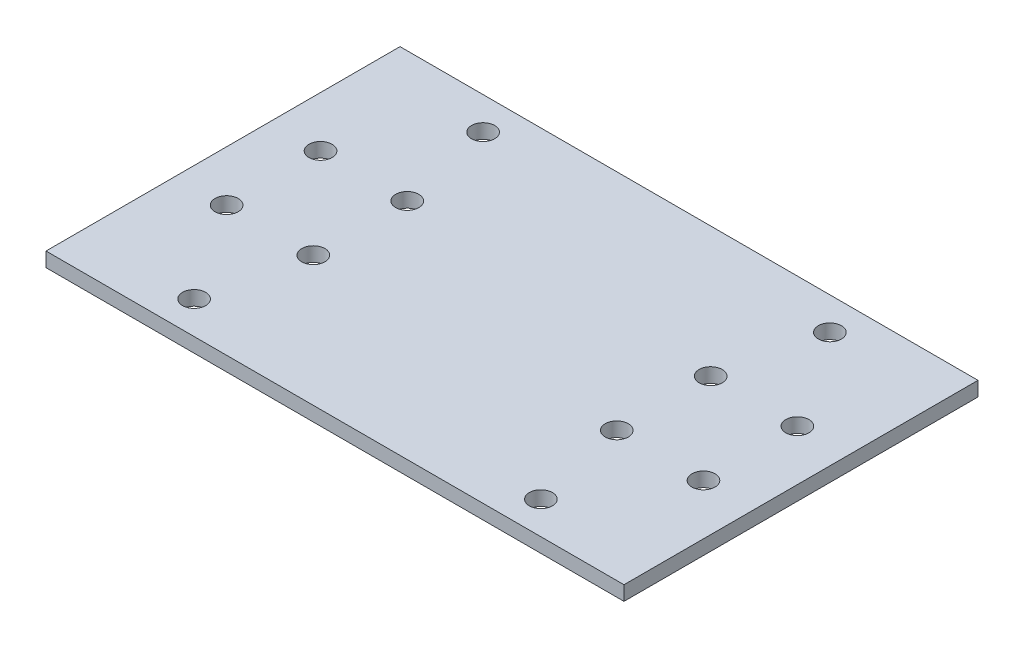
ISO-10303-21;
HEADER;
FILE_DESCRIPTION(('STEP AP214'),'2;1');
FILE_NAME('part.step','',(''),(''),'','','');
FILE_SCHEMA(('AUTOMOTIVE_DESIGN { 1 0 10303 214 1 1 1 1 }'));
ENDSEC;
DATA;
#1=APPLICATION_CONTEXT('core data for automotive mechanical design processes');
#2=APPLICATION_PROTOCOL_DEFINITION('international standard','automotive_design',2000,#1);
#3=PRODUCT_CONTEXT('',#1,'mechanical');
#4=PRODUCT('Part','Part','',(#3));
#5=PRODUCT_RELATED_PRODUCT_CATEGORY('part','',(#4));
#6=PRODUCT_DEFINITION_FORMATION('','',#4);
#7=PRODUCT_DEFINITION_CONTEXT('part definition',#1,'design');
#8=PRODUCT_DEFINITION('design','',#6,#7);
#9=PRODUCT_DEFINITION_SHAPE('','',#8);
#10=(LENGTH_UNIT() NAMED_UNIT(*) SI_UNIT(.MILLI.,.METRE.));
#11=(NAMED_UNIT(*) PLANE_ANGLE_UNIT() SI_UNIT($,.RADIAN.));
#12=(NAMED_UNIT(*) SI_UNIT($,.STERADIAN.) SOLID_ANGLE_UNIT());
#13=UNCERTAINTY_MEASURE_WITH_UNIT(LENGTH_MEASURE(1.E-05),#10,'distance_accuracy_value','');
#14=(GEOMETRIC_REPRESENTATION_CONTEXT(3) GLOBAL_UNCERTAINTY_ASSIGNED_CONTEXT((#13)) GLOBAL_UNIT_ASSIGNED_CONTEXT((#10,
#11,#12)) REPRESENTATION_CONTEXT('',''));
#15=CARTESIAN_POINT('',(0.,0.,0.));
#16=DIRECTION('',(0.,0.,1.));
#17=DIRECTION('',(1.,0.,0.));
#18=AXIS2_PLACEMENT_3D('',#15,#16,#17);
#19=CARTESIAN_POINT('',(0.,2.,0.));
#20=DIRECTION('',(0.,-1.,0.));
#21=DIRECTION('',(0.,0.,-1.));
#22=AXIS2_PLACEMENT_3D('',#19,#20,#21);
#23=PLANE('',#22);
#24=DIRECTION('',(0.,0.,-1.));
#25=VECTOR('',#24,1.);
#26=CARTESIAN_POINT('',(40.,2.,24.5));
#27=LINE('',#26,#25);
#28=CARTESIAN_POINT('',(40.,2.,24.5));
#29=VERTEX_POINT('',#28);
#30=CARTESIAN_POINT('',(40.,2.,-24.5));
#31=VERTEX_POINT('',#30);
#32=EDGE_CURVE('E85',#29,#31,#27,.T.);
#33=ORIENTED_EDGE('',*,*,#32,.T.);
#34=DIRECTION('',(-1.,0.,0.));
#35=VECTOR('',#34,1.);
#36=CARTESIAN_POINT('',(-40.,2.,-24.5));
#37=LINE('',#36,#35);
#38=CARTESIAN_POINT('',(-40.,2.,-24.5));
#39=VERTEX_POINT('',#38);
#40=EDGE_CURVE('E80',#31,#39,#37,.T.);
#41=ORIENTED_EDGE('',*,*,#40,.T.);
#42=DIRECTION('',(0.,0.,1.));
#43=VECTOR('',#42,1.);
#44=CARTESIAN_POINT('',(-40.,2.,24.5));
#45=LINE('',#44,#43);
#46=CARTESIAN_POINT('',(-40.,2.,24.5));
#47=VERTEX_POINT('',#46);
#48=EDGE_CURVE('E83',#39,#47,#45,.T.);
#49=ORIENTED_EDGE('',*,*,#48,.T.);
#50=DIRECTION('',(1.,0.,0.));
#51=VECTOR('',#50,1.);
#52=CARTESIAN_POINT('',(-40.,2.,24.5));
#53=LINE('',#52,#51);
#54=EDGE_CURVE('E50',#47,#29,#53,.T.);
#55=ORIENTED_EDGE('',*,*,#54,.T.);
#56=EDGE_LOOP('',(#33,#41,#49,#55));
#57=FACE_BOUND('',#56,.T.);
#58=CARTESIAN_POINT('',(-33.,2.,-6.5));
#59=DIRECTION('',(0.,1.,0.));
#60=DIRECTION('',(0.,0.,1.));
#61=AXIS2_PLACEMENT_3D('',#58,#59,#60);
#62=CIRCLE('',#61,1.60000000000001);
#63=CARTESIAN_POINT('',(-33.,2.,-4.89999999999999));
#64=VERTEX_POINT('',#63);
#65=EDGE_CURVE('E100',#64,#64,#62,.T.);
#66=ORIENTED_EDGE('',*,*,#65,.F.);
#67=EDGE_LOOP('',(#66));
#68=FACE_BOUND('',#67,.T.);
#69=CARTESIAN_POINT('',(33.,2.,-6.5));
#70=DIRECTION('',(0.,1.,0.));
#71=DIRECTION('',(0.,0.,-1.));
#72=AXIS2_PLACEMENT_3D('',#69,#70,#71);
#73=CIRCLE('',#72,1.6);
#74=CARTESIAN_POINT('',(33.,2.,-8.1));
#75=VERTEX_POINT('',#74);
#76=EDGE_CURVE('E115',#75,#75,#73,.T.);
#77=ORIENTED_EDGE('',*,*,#76,.F.);
#78=EDGE_LOOP('',(#77));
#79=FACE_BOUND('',#78,.T.);
#80=CARTESIAN_POINT('',(33.,2.,6.5));
#81=DIRECTION('',(0.,1.,0.));
#82=DIRECTION('',(0.,0.,1.));
#83=AXIS2_PLACEMENT_3D('',#80,#81,#82);
#84=CIRCLE('',#83,1.60000000000001);
#85=CARTESIAN_POINT('',(33.,2.,8.1));
#86=VERTEX_POINT('',#85);
#87=EDGE_CURVE('E121',#86,#86,#84,.T.);
#88=ORIENTED_EDGE('',*,*,#87,.F.);
#89=EDGE_LOOP('',(#88));
#90=FACE_BOUND('',#89,.T.);
#91=CARTESIAN_POINT('',(-33.,2.,6.5));
#92=DIRECTION('',(0.,1.,0.));
#93=DIRECTION('',(0.,0.,-1.));
#94=AXIS2_PLACEMENT_3D('',#91,#92,#93);
#95=CIRCLE('',#94,1.60000000000001);
#96=CARTESIAN_POINT('',(-33.,2.,4.89999999999999));
#97=VERTEX_POINT('',#96);
#98=EDGE_CURVE('E127',#97,#97,#95,.T.);
#99=ORIENTED_EDGE('',*,*,#98,.F.);
#100=EDGE_LOOP('',(#99));
#101=FACE_BOUND('',#100,.T.);
#102=CARTESIAN_POINT('',(21.,2.,-6.5));
#103=DIRECTION('',(0.,1.,0.));
#104=DIRECTION('',(0.,0.,-1.));
#105=AXIS2_PLACEMENT_3D('',#102,#103,#104);
#106=CIRCLE('',#105,1.6);
#107=CARTESIAN_POINT('',(21.,2.,-8.10000000000001));
#108=VERTEX_POINT('',#107);
#109=EDGE_CURVE('E133',#108,#108,#106,.T.);
#110=ORIENTED_EDGE('',*,*,#109,.F.);
#111=EDGE_LOOP('',(#110));
#112=FACE_BOUND('',#111,.T.);
#113=CARTESIAN_POINT('',(-21.,2.,-6.5));
#114=DIRECTION('',(0.,1.,0.));
#115=DIRECTION('',(0.,0.,1.));
#116=AXIS2_PLACEMENT_3D('',#113,#114,#115);
#117=CIRCLE('',#116,1.6);
#118=CARTESIAN_POINT('',(-21.,2.,-4.9));
#119=VERTEX_POINT('',#118);
#120=EDGE_CURVE('E139',#119,#119,#117,.T.);
#121=ORIENTED_EDGE('',*,*,#120,.F.);
#122=EDGE_LOOP('',(#121));
#123=FACE_BOUND('',#122,.T.);
#124=CARTESIAN_POINT('',(-21.,2.,6.50000000000001));
#125=DIRECTION('',(0.,1.,0.));
#126=DIRECTION('',(0.,0.,-1.));
#127=AXIS2_PLACEMENT_3D('',#124,#125,#126);
#128=CIRCLE('',#127,1.6);
#129=CARTESIAN_POINT('',(-21.,2.,4.90000000000001));
#130=VERTEX_POINT('',#129);
#131=EDGE_CURVE('E145',#130,#130,#128,.T.);
#132=ORIENTED_EDGE('',*,*,#131,.F.);
#133=EDGE_LOOP('',(#132));
#134=FACE_BOUND('',#133,.T.);
#135=CARTESIAN_POINT('',(21.,2.,6.5));
#136=DIRECTION('',(0.,1.,0.));
#137=DIRECTION('',(0.,0.,1.));
#138=AXIS2_PLACEMENT_3D('',#135,#136,#137);
#139=CIRCLE('',#138,1.6);
#140=CARTESIAN_POINT('',(21.,2.,8.10000000000001));
#141=VERTEX_POINT('',#140);
#142=EDGE_CURVE('E151',#141,#141,#139,.T.);
#143=ORIENTED_EDGE('',*,*,#142,.F.);
#144=EDGE_LOOP('',(#143));
#145=FACE_BOUND('',#144,.T.);
#146=CARTESIAN_POINT('',(24.,2.,20.));
#147=DIRECTION('',(0.,1.,0.));
#148=DIRECTION('',(0.,0.,-1.));
#149=AXIS2_PLACEMENT_3D('',#146,#147,#148);
#150=CIRCLE('',#149,1.6);
#151=CARTESIAN_POINT('',(24.,2.,18.4));
#152=VERTEX_POINT('',#151);
#153=EDGE_CURVE('E157',#152,#152,#150,.T.);
#154=ORIENTED_EDGE('',*,*,#153,.F.);
#155=EDGE_LOOP('',(#154));
#156=FACE_BOUND('',#155,.T.);
#157=CARTESIAN_POINT('',(24.,2.,-20.));
#158=DIRECTION('',(0.,1.,0.));
#159=DIRECTION('',(0.,0.,1.));
#160=AXIS2_PLACEMENT_3D('',#157,#158,#159);
#161=CIRCLE('',#160,1.6);
#162=CARTESIAN_POINT('',(24.,2.,-18.4));
#163=VERTEX_POINT('',#162);
#164=EDGE_CURVE('E163',#163,#163,#161,.T.);
#165=ORIENTED_EDGE('',*,*,#164,.F.);
#166=EDGE_LOOP('',(#165));
#167=FACE_BOUND('',#166,.T.);
#168=CARTESIAN_POINT('',(-24.,2.,-20.));
#169=DIRECTION('',(0.,1.,0.));
#170=DIRECTION('',(0.,0.,-1.));
#171=AXIS2_PLACEMENT_3D('',#168,#169,#170);
#172=CIRCLE('',#171,1.6);
#173=CARTESIAN_POINT('',(-24.,2.,-21.6));
#174=VERTEX_POINT('',#173);
#175=EDGE_CURVE('E169',#174,#174,#172,.T.);
#176=ORIENTED_EDGE('',*,*,#175,.F.);
#177=EDGE_LOOP('',(#176));
#178=FACE_BOUND('',#177,.T.);
#179=CARTESIAN_POINT('',(-24.,2.,20.));
#180=DIRECTION('',(0.,1.,0.));
#181=DIRECTION('',(0.,0.,1.));
#182=AXIS2_PLACEMENT_3D('',#179,#180,#181);
#183=CIRCLE('',#182,1.6);
#184=CARTESIAN_POINT('',(-24.,2.,21.6));
#185=VERTEX_POINT('',#184);
#186=EDGE_CURVE('E175',#185,#185,#183,.T.);
#187=ORIENTED_EDGE('',*,*,#186,.F.);
#188=EDGE_LOOP('',(#187));
#189=FACE_BOUND('',#188,.T.);
#190=ADVANCED_FACE('F33',(#57,#68,#79,#90,#101,#112,#123,#134,#145,#156,#167,#178,#189),#23,.F.);
#191=CARTESIAN_POINT('',(0.,0.,0.));
#192=DIRECTION('',(0.,-1.,0.));
#193=DIRECTION('',(0.,0.,-1.));
#194=AXIS2_PLACEMENT_3D('',#191,#192,#193);
#195=PLANE('',#194);
#196=CARTESIAN_POINT('',(-24.,0.,-20.));
#197=DIRECTION('',(0.,1.,0.));
#198=DIRECTION('',(0.,0.,-1.));
#199=AXIS2_PLACEMENT_3D('',#196,#197,#198);
#200=CIRCLE('',#199,1.6);
#201=CARTESIAN_POINT('',(-24.,0.,-21.6));
#202=VERTEX_POINT('',#201);
#203=EDGE_CURVE('E172',#202,#202,#200,.T.);
#204=ORIENTED_EDGE('',*,*,#203,.T.);
#205=EDGE_LOOP('',(#204));
#206=FACE_BOUND('',#205,.T.);
#207=CARTESIAN_POINT('',(24.,0.,20.));
#208=DIRECTION('',(0.,1.,0.));
#209=DIRECTION('',(0.,0.,-1.));
#210=AXIS2_PLACEMENT_3D('',#207,#208,#209);
#211=CIRCLE('',#210,1.6);
#212=CARTESIAN_POINT('',(24.,0.,18.4));
#213=VERTEX_POINT('',#212);
#214=EDGE_CURVE('E160',#213,#213,#211,.T.);
#215=ORIENTED_EDGE('',*,*,#214,.T.);
#216=EDGE_LOOP('',(#215));
#217=FACE_BOUND('',#216,.T.);
#218=CARTESIAN_POINT('',(-21.,0.,6.50000000000001));
#219=DIRECTION('',(0.,1.,0.));
#220=DIRECTION('',(0.,0.,-1.));
#221=AXIS2_PLACEMENT_3D('',#218,#219,#220);
#222=CIRCLE('',#221,1.6);
#223=CARTESIAN_POINT('',(-21.,0.,4.90000000000001));
#224=VERTEX_POINT('',#223);
#225=EDGE_CURVE('E148',#224,#224,#222,.T.);
#226=ORIENTED_EDGE('',*,*,#225,.T.);
#227=EDGE_LOOP('',(#226));
#228=FACE_BOUND('',#227,.T.);
#229=CARTESIAN_POINT('',(21.,0.,-6.5));
#230=DIRECTION('',(0.,1.,0.));
#231=DIRECTION('',(0.,0.,-1.));
#232=AXIS2_PLACEMENT_3D('',#229,#230,#231);
#233=CIRCLE('',#232,1.6);
#234=CARTESIAN_POINT('',(21.,0.,-8.10000000000001));
#235=VERTEX_POINT('',#234);
#236=EDGE_CURVE('E136',#235,#235,#233,.T.);
#237=ORIENTED_EDGE('',*,*,#236,.T.);
#238=EDGE_LOOP('',(#237));
#239=FACE_BOUND('',#238,.T.);
#240=CARTESIAN_POINT('',(33.,0.,6.5));
#241=DIRECTION('',(0.,1.,0.));
#242=DIRECTION('',(0.,0.,1.));
#243=AXIS2_PLACEMENT_3D('',#240,#241,#242);
#244=CIRCLE('',#243,1.60000000000001);
#245=CARTESIAN_POINT('',(33.,0.,8.1));
#246=VERTEX_POINT('',#245);
#247=EDGE_CURVE('E124',#246,#246,#244,.T.);
#248=ORIENTED_EDGE('',*,*,#247,.T.);
#249=EDGE_LOOP('',(#248));
#250=FACE_BOUND('',#249,.T.);
#251=CARTESIAN_POINT('',(-33.,0.,-6.5));
#252=DIRECTION('',(0.,1.,0.));
#253=DIRECTION('',(0.,0.,1.));
#254=AXIS2_PLACEMENT_3D('',#251,#252,#253);
#255=CIRCLE('',#254,1.60000000000001);
#256=CARTESIAN_POINT('',(-33.,0.,-4.89999999999999));
#257=VERTEX_POINT('',#256);
#258=EDGE_CURVE('E112',#257,#257,#255,.T.);
#259=ORIENTED_EDGE('',*,*,#258,.T.);
#260=EDGE_LOOP('',(#259));
#261=FACE_BOUND('',#260,.T.);
#262=DIRECTION('',(0.,0.,-1.));
#263=VECTOR('',#262,1.);
#264=CARTESIAN_POINT('',(40.,0.,24.5));
#265=LINE('',#264,#263);
#266=CARTESIAN_POINT('',(40.,0.,24.5));
#267=VERTEX_POINT('',#266);
#268=CARTESIAN_POINT('',(40.,0.,-24.5));
#269=VERTEX_POINT('',#268);
#270=EDGE_CURVE('E97',#267,#269,#265,.T.);
#271=ORIENTED_EDGE('',*,*,#270,.F.);
#272=DIRECTION('',(1.,0.,0.));
#273=VECTOR('',#272,1.);
#274=CARTESIAN_POINT('',(-40.,0.,24.5));
#275=LINE('',#274,#273);
#276=CARTESIAN_POINT('',(-40.,0.,24.5));
#277=VERTEX_POINT('',#276);
#278=EDGE_CURVE('E73',#277,#267,#275,.T.);
#279=ORIENTED_EDGE('',*,*,#278,.F.);
#280=DIRECTION('',(0.,0.,1.));
#281=VECTOR('',#280,1.);
#282=CARTESIAN_POINT('',(-40.,0.,24.5));
#283=LINE('',#282,#281);
#284=CARTESIAN_POINT('',(-40.,0.,-24.5));
#285=VERTEX_POINT('',#284);
#286=EDGE_CURVE('E67',#285,#277,#283,.T.);
#287=ORIENTED_EDGE('',*,*,#286,.F.);
#288=DIRECTION('',(-1.,0.,0.));
#289=VECTOR('',#288,1.);
#290=CARTESIAN_POINT('',(-40.,0.,-24.5));
#291=LINE('',#290,#289);
#292=EDGE_CURVE('E89',#269,#285,#291,.T.);
#293=ORIENTED_EDGE('',*,*,#292,.F.);
#294=EDGE_LOOP('',(#271,#279,#287,#293));
#295=FACE_BOUND('',#294,.T.);
#296=CARTESIAN_POINT('',(33.,0.,-6.5));
#297=DIRECTION('',(0.,1.,0.));
#298=DIRECTION('',(0.,0.,-1.));
#299=AXIS2_PLACEMENT_3D('',#296,#297,#298);
#300=CIRCLE('',#299,1.6);
#301=CARTESIAN_POINT('',(33.,0.,-8.1));
#302=VERTEX_POINT('',#301);
#303=EDGE_CURVE('E118',#302,#302,#300,.T.);
#304=ORIENTED_EDGE('',*,*,#303,.T.);
#305=EDGE_LOOP('',(#304));
#306=FACE_BOUND('',#305,.T.);
#307=CARTESIAN_POINT('',(-33.,0.,6.5));
#308=DIRECTION('',(0.,1.,0.));
#309=DIRECTION('',(0.,0.,-1.));
#310=AXIS2_PLACEMENT_3D('',#307,#308,#309);
#311=CIRCLE('',#310,1.60000000000001);
#312=CARTESIAN_POINT('',(-33.,0.,4.89999999999999));
#313=VERTEX_POINT('',#312);
#314=EDGE_CURVE('E130',#313,#313,#311,.T.);
#315=ORIENTED_EDGE('',*,*,#314,.T.);
#316=EDGE_LOOP('',(#315));
#317=FACE_BOUND('',#316,.T.);
#318=CARTESIAN_POINT('',(-21.,0.,-6.5));
#319=DIRECTION('',(0.,1.,0.));
#320=DIRECTION('',(0.,0.,1.));
#321=AXIS2_PLACEMENT_3D('',#318,#319,#320);
#322=CIRCLE('',#321,1.6);
#323=CARTESIAN_POINT('',(-21.,0.,-4.9));
#324=VERTEX_POINT('',#323);
#325=EDGE_CURVE('E142',#324,#324,#322,.T.);
#326=ORIENTED_EDGE('',*,*,#325,.T.);
#327=EDGE_LOOP('',(#326));
#328=FACE_BOUND('',#327,.T.);
#329=CARTESIAN_POINT('',(21.,0.,6.5));
#330=DIRECTION('',(0.,1.,0.));
#331=DIRECTION('',(0.,0.,1.));
#332=AXIS2_PLACEMENT_3D('',#329,#330,#331);
#333=CIRCLE('',#332,1.6);
#334=CARTESIAN_POINT('',(21.,0.,8.10000000000001));
#335=VERTEX_POINT('',#334);
#336=EDGE_CURVE('E154',#335,#335,#333,.T.);
#337=ORIENTED_EDGE('',*,*,#336,.T.);
#338=EDGE_LOOP('',(#337));
#339=FACE_BOUND('',#338,.T.);
#340=CARTESIAN_POINT('',(24.,0.,-20.));
#341=DIRECTION('',(0.,1.,0.));
#342=DIRECTION('',(0.,0.,1.));
#343=AXIS2_PLACEMENT_3D('',#340,#341,#342);
#344=CIRCLE('',#343,1.6);
#345=CARTESIAN_POINT('',(24.,0.,-18.4));
#346=VERTEX_POINT('',#345);
#347=EDGE_CURVE('E166',#346,#346,#344,.T.);
#348=ORIENTED_EDGE('',*,*,#347,.T.);
#349=EDGE_LOOP('',(#348));
#350=FACE_BOUND('',#349,.T.);
#351=CARTESIAN_POINT('',(-24.,0.,20.));
#352=DIRECTION('',(0.,1.,0.));
#353=DIRECTION('',(0.,0.,1.));
#354=AXIS2_PLACEMENT_3D('',#351,#352,#353);
#355=CIRCLE('',#354,1.6);
#356=CARTESIAN_POINT('',(-24.,0.,21.6));
#357=VERTEX_POINT('',#356);
#358=EDGE_CURVE('E178',#357,#357,#355,.T.);
#359=ORIENTED_EDGE('',*,*,#358,.T.);
#360=EDGE_LOOP('',(#359));
#361=FACE_BOUND('',#360,.T.);
#362=ADVANCED_FACE('F108',(#206,#217,#228,#239,#250,#261,#295,#306,#317,#328,#339,#350,#361),
#195,.T.);
#363=CARTESIAN_POINT('',(40.,2.,24.5));
#364=DIRECTION('',(-1.,0.,0.));
#365=DIRECTION('',(0.,0.,1.));
#366=AXIS2_PLACEMENT_3D('',#363,#364,#365);
#367=PLANE('',#366);
#368=ORIENTED_EDGE('',*,*,#270,.T.);
#369=DIRECTION('',(0.,-1.,0.));
#370=VECTOR('',#369,1.);
#371=CARTESIAN_POINT('',(40.,2.,-24.5));
#372=LINE('',#371,#370);
#373=EDGE_CURVE('E11',#31,#269,#372,.T.);
#374=ORIENTED_EDGE('',*,*,#373,.F.);
#375=ORIENTED_EDGE('',*,*,#32,.F.);
#376=DIRECTION('',(0.,-1.,0.));
#377=VECTOR('',#376,1.);
#378=CARTESIAN_POINT('',(40.,2.,24.5));
#379=LINE('',#378,#377);
#380=EDGE_CURVE('E93',#29,#267,#379,.T.);
#381=ORIENTED_EDGE('',*,*,#380,.T.);
#382=EDGE_LOOP('',(#368,#374,#375,#381));
#383=FACE_BOUND('',#382,.T.);
#384=ADVANCED_FACE('F35',(#383),#367,.F.);
#385=CARTESIAN_POINT('',(-40.,2.,-24.5));
#386=DIRECTION('',(0.,0.,1.));
#387=DIRECTION('',(1.,0.,0.));
#388=AXIS2_PLACEMENT_3D('',#385,#386,#387);
#389=PLANE('',#388);
#390=ORIENTED_EDGE('',*,*,#292,.T.);
#391=DIRECTION('',(0.,-1.,0.));
#392=VECTOR('',#391,1.);
#393=CARTESIAN_POINT('',(-40.,2.,-24.5));
#394=LINE('',#393,#392);
#395=EDGE_CURVE('E42',#39,#285,#394,.T.);
#396=ORIENTED_EDGE('',*,*,#395,.F.);
#397=ORIENTED_EDGE('',*,*,#40,.F.);
#398=ORIENTED_EDGE('',*,*,#373,.T.);
#399=EDGE_LOOP('',(#390,#396,#397,#398));
#400=FACE_BOUND('',#399,.T.);
#401=ADVANCED_FACE('F88',(#400),#389,.F.);
#402=CARTESIAN_POINT('',(-40.,2.,24.5));
#403=DIRECTION('',(1.,0.,0.));
#404=DIRECTION('',(0.,0.,-1.));
#405=AXIS2_PLACEMENT_3D('',#402,#403,#404);
#406=PLANE('',#405);
#407=ORIENTED_EDGE('',*,*,#286,.T.);
#408=DIRECTION('',(0.,-1.,0.));
#409=VECTOR('',#408,1.);
#410=CARTESIAN_POINT('',(-40.,2.,24.5));
#411=LINE('',#410,#409);
#412=EDGE_CURVE('E90',#47,#277,#411,.T.);
#413=ORIENTED_EDGE('',*,*,#412,.F.);
#414=ORIENTED_EDGE('',*,*,#48,.F.);
#415=ORIENTED_EDGE('',*,*,#395,.T.);
#416=EDGE_LOOP('',(#407,#413,#414,#415));
#417=FACE_BOUND('',#416,.T.);
#418=ADVANCED_FACE('F91',(#417),#406,.F.);
#419=CARTESIAN_POINT('',(-40.,2.,24.5));
#420=DIRECTION('',(0.,0.,-1.));
#421=DIRECTION('',(-1.,0.,0.));
#422=AXIS2_PLACEMENT_3D('',#419,#420,#421);
#423=PLANE('',#422);
#424=ORIENTED_EDGE('',*,*,#278,.T.);
#425=ORIENTED_EDGE('',*,*,#380,.F.);
#426=ORIENTED_EDGE('',*,*,#54,.F.);
#427=ORIENTED_EDGE('',*,*,#412,.T.);
#428=EDGE_LOOP('',(#424,#425,#426,#427));
#429=FACE_BOUND('',#428,.T.);
#430=ADVANCED_FACE('F105',(#429),#423,.F.);
#431=CARTESIAN_POINT('',(-33.,2.,-6.5));
#432=DIRECTION('',(0.,-1.,0.));
#433=DIRECTION('',(0.,0.,-1.));
#434=AXIS2_PLACEMENT_3D('',#431,#432,#433);
#435=CYLINDRICAL_SURFACE('',#434,1.60000000000001);
#436=ORIENTED_EDGE('',*,*,#65,.T.);
#437=EDGE_LOOP('',(#436));
#438=FACE_BOUND('',#437,.T.);
#439=ORIENTED_EDGE('',*,*,#258,.F.);
#440=EDGE_LOOP('',(#439));
#441=FACE_BOUND('',#440,.T.);
#442=ADVANCED_FACE('F195',(#438,#441),#435,.F.);
#443=CARTESIAN_POINT('',(33.,2.,-6.5));
#444=DIRECTION('',(0.,-1.,0.));
#445=DIRECTION('',(0.,0.,-1.));
#446=AXIS2_PLACEMENT_3D('',#443,#444,#445);
#447=CYLINDRICAL_SURFACE('',#446,1.6);
#448=ORIENTED_EDGE('',*,*,#76,.T.);
#449=EDGE_LOOP('',(#448));
#450=FACE_BOUND('',#449,.T.);
#451=ORIENTED_EDGE('',*,*,#303,.F.);
#452=EDGE_LOOP('',(#451));
#453=FACE_BOUND('',#452,.T.);
#454=ADVANCED_FACE('F241',(#450,#453),#447,.F.);
#455=CARTESIAN_POINT('',(33.,2.,6.5));
#456=DIRECTION('',(0.,-1.,0.));
#457=DIRECTION('',(0.,0.,-1.));
#458=AXIS2_PLACEMENT_3D('',#455,#456,#457);
#459=CYLINDRICAL_SURFACE('',#458,1.60000000000001);
#460=ORIENTED_EDGE('',*,*,#87,.T.);
#461=EDGE_LOOP('',(#460));
#462=FACE_BOUND('',#461,.T.);
#463=ORIENTED_EDGE('',*,*,#247,.F.);
#464=EDGE_LOOP('',(#463));
#465=FACE_BOUND('',#464,.T.);
#466=ADVANCED_FACE('F249',(#462,#465),#459,.F.);
#467=CARTESIAN_POINT('',(-33.,2.,6.5));
#468=DIRECTION('',(0.,-1.,0.));
#469=DIRECTION('',(0.,0.,-1.));
#470=AXIS2_PLACEMENT_3D('',#467,#468,#469);
#471=CYLINDRICAL_SURFACE('',#470,1.60000000000001);
#472=ORIENTED_EDGE('',*,*,#98,.T.);
#473=EDGE_LOOP('',(#472));
#474=FACE_BOUND('',#473,.T.);
#475=ORIENTED_EDGE('',*,*,#314,.F.);
#476=EDGE_LOOP('',(#475));
#477=FACE_BOUND('',#476,.T.);
#478=ADVANCED_FACE('F257',(#474,#477),#471,.F.);
#479=CARTESIAN_POINT('',(21.,2.,-6.5));
#480=DIRECTION('',(0.,-1.,0.));
#481=DIRECTION('',(0.,0.,-1.));
#482=AXIS2_PLACEMENT_3D('',#479,#480,#481);
#483=CYLINDRICAL_SURFACE('',#482,1.6);
#484=ORIENTED_EDGE('',*,*,#109,.T.);
#485=EDGE_LOOP('',(#484));
#486=FACE_BOUND('',#485,.T.);
#487=ORIENTED_EDGE('',*,*,#236,.F.);
#488=EDGE_LOOP('',(#487));
#489=FACE_BOUND('',#488,.T.);
#490=ADVANCED_FACE('F266',(#486,#489),#483,.F.);
#491=CARTESIAN_POINT('',(-21.,2.,-6.5));
#492=DIRECTION('',(0.,-1.,0.));
#493=DIRECTION('',(0.,0.,-1.));
#494=AXIS2_PLACEMENT_3D('',#491,#492,#493);
#495=CYLINDRICAL_SURFACE('',#494,1.6);
#496=ORIENTED_EDGE('',*,*,#120,.T.);
#497=EDGE_LOOP('',(#496));
#498=FACE_BOUND('',#497,.T.);
#499=ORIENTED_EDGE('',*,*,#325,.F.);
#500=EDGE_LOOP('',(#499));
#501=FACE_BOUND('',#500,.T.);
#502=ADVANCED_FACE('F275',(#498,#501),#495,.F.);
#503=CARTESIAN_POINT('',(-21.,2.,6.50000000000001));
#504=DIRECTION('',(0.,-1.,0.));
#505=DIRECTION('',(0.,0.,-1.));
#506=AXIS2_PLACEMENT_3D('',#503,#504,#505);
#507=CYLINDRICAL_SURFACE('',#506,1.6);
#508=ORIENTED_EDGE('',*,*,#131,.T.);
#509=EDGE_LOOP('',(#508));
#510=FACE_BOUND('',#509,.T.);
#511=ORIENTED_EDGE('',*,*,#225,.F.);
#512=EDGE_LOOP('',(#511));
#513=FACE_BOUND('',#512,.T.);
#514=ADVANCED_FACE('F284',(#510,#513),#507,.F.);
#515=CARTESIAN_POINT('',(21.,2.,6.5));
#516=DIRECTION('',(0.,-1.,0.));
#517=DIRECTION('',(0.,0.,-1.));
#518=AXIS2_PLACEMENT_3D('',#515,#516,#517);
#519=CYLINDRICAL_SURFACE('',#518,1.6);
#520=ORIENTED_EDGE('',*,*,#142,.T.);
#521=EDGE_LOOP('',(#520));
#522=FACE_BOUND('',#521,.T.);
#523=ORIENTED_EDGE('',*,*,#336,.F.);
#524=EDGE_LOOP('',(#523));
#525=FACE_BOUND('',#524,.T.);
#526=ADVANCED_FACE('F293',(#522,#525),#519,.F.);
#527=CARTESIAN_POINT('',(24.,2.,20.));
#528=DIRECTION('',(0.,-1.,0.));
#529=DIRECTION('',(0.,0.,-1.));
#530=AXIS2_PLACEMENT_3D('',#527,#528,#529);
#531=CYLINDRICAL_SURFACE('',#530,1.6);
#532=ORIENTED_EDGE('',*,*,#153,.T.);
#533=EDGE_LOOP('',(#532));
#534=FACE_BOUND('',#533,.T.);
#535=ORIENTED_EDGE('',*,*,#214,.F.);
#536=EDGE_LOOP('',(#535));
#537=FACE_BOUND('',#536,.T.);
#538=ADVANCED_FACE('F302',(#534,#537),#531,.F.);
#539=CARTESIAN_POINT('',(24.,2.,-20.));
#540=DIRECTION('',(0.,-1.,0.));
#541=DIRECTION('',(0.,0.,-1.));
#542=AXIS2_PLACEMENT_3D('',#539,#540,#541);
#543=CYLINDRICAL_SURFACE('',#542,1.6);
#544=ORIENTED_EDGE('',*,*,#164,.T.);
#545=EDGE_LOOP('',(#544));
#546=FACE_BOUND('',#545,.T.);
#547=ORIENTED_EDGE('',*,*,#347,.F.);
#548=EDGE_LOOP('',(#547));
#549=FACE_BOUND('',#548,.T.);
#550=ADVANCED_FACE('F311',(#546,#549),#543,.F.);
#551=CARTESIAN_POINT('',(-24.,2.,-20.));
#552=DIRECTION('',(0.,-1.,0.));
#553=DIRECTION('',(0.,0.,-1.));
#554=AXIS2_PLACEMENT_3D('',#551,#552,#553);
#555=CYLINDRICAL_SURFACE('',#554,1.6);
#556=ORIENTED_EDGE('',*,*,#175,.T.);
#557=EDGE_LOOP('',(#556));
#558=FACE_BOUND('',#557,.T.);
#559=ORIENTED_EDGE('',*,*,#203,.F.);
#560=EDGE_LOOP('',(#559));
#561=FACE_BOUND('',#560,.T.);
#562=ADVANCED_FACE('F320',(#558,#561),#555,.F.);
#563=CARTESIAN_POINT('',(-24.,2.,20.));
#564=DIRECTION('',(0.,-1.,0.));
#565=DIRECTION('',(0.,0.,-1.));
#566=AXIS2_PLACEMENT_3D('',#563,#564,#565);
#567=CYLINDRICAL_SURFACE('',#566,1.6);
#568=ORIENTED_EDGE('',*,*,#186,.T.);
#569=EDGE_LOOP('',(#568));
#570=FACE_BOUND('',#569,.T.);
#571=ORIENTED_EDGE('',*,*,#358,.F.);
#572=EDGE_LOOP('',(#571));
#573=FACE_BOUND('',#572,.T.);
#574=ADVANCED_FACE('F184',(#570,#573),#567,.F.);
#575=CLOSED_SHELL('',(#190,#362,#384,#401,#418,#430,#442,#454,#466,#478,#490,#502,#514,#526,
#538,#550,#562,#574));
#576=MANIFOLD_SOLID_BREP('B2',#575);
#577=ADVANCED_BREP_SHAPE_REPRESENTATION('',(#18,#576),#14);
#578=SHAPE_DEFINITION_REPRESENTATION(#9,#577);
ENDSEC;
END-ISO-10303-21;
